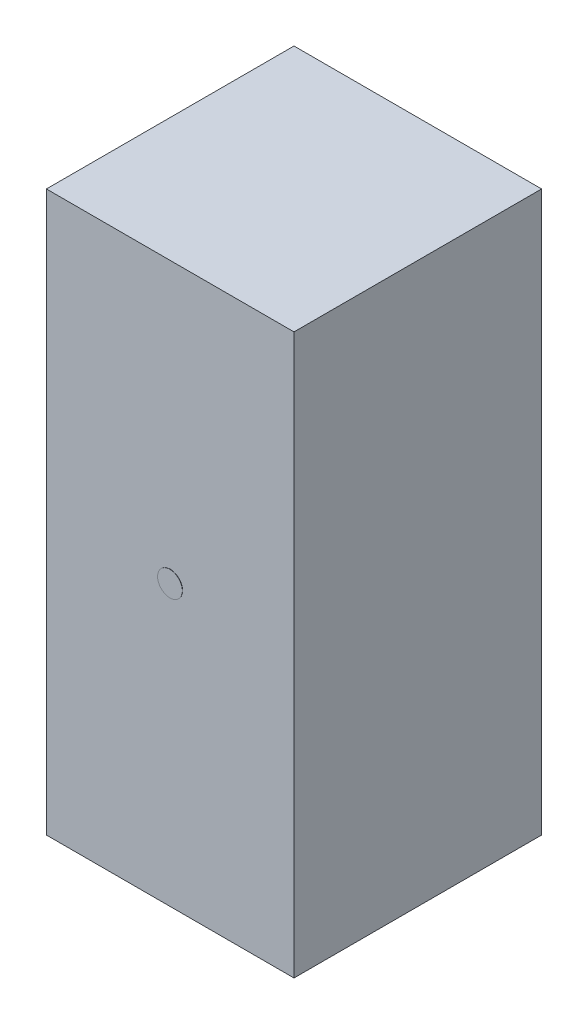
ISO-10303-21;
HEADER;
FILE_DESCRIPTION(('STEP AP214'),'2;1');
FILE_NAME('part.step','',(''),(''),'','','');
FILE_SCHEMA(('AUTOMOTIVE_DESIGN { 1 0 10303 214 1 1 1 1 }'));
ENDSEC;
DATA;
#1=APPLICATION_CONTEXT('core data for automotive mechanical design processes');
#2=APPLICATION_PROTOCOL_DEFINITION('international standard','automotive_design',2000,#1);
#3=PRODUCT_CONTEXT('',#1,'mechanical');
#4=PRODUCT('Part','Part','',(#3));
#5=PRODUCT_RELATED_PRODUCT_CATEGORY('part','',(#4));
#6=PRODUCT_DEFINITION_FORMATION('','',#4);
#7=PRODUCT_DEFINITION_CONTEXT('part definition',#1,'design');
#8=PRODUCT_DEFINITION('design','',#6,#7);
#9=PRODUCT_DEFINITION_SHAPE('','',#8);
#10=(LENGTH_UNIT() NAMED_UNIT(*) SI_UNIT(.MILLI.,.METRE.));
#11=(NAMED_UNIT(*) PLANE_ANGLE_UNIT() SI_UNIT($,.RADIAN.));
#12=(NAMED_UNIT(*) SI_UNIT($,.STERADIAN.) SOLID_ANGLE_UNIT());
#13=UNCERTAINTY_MEASURE_WITH_UNIT(LENGTH_MEASURE(1.E-05),#10,'distance_accuracy_value','');
#14=(GEOMETRIC_REPRESENTATION_CONTEXT(3) GLOBAL_UNCERTAINTY_ASSIGNED_CONTEXT((#13)) GLOBAL_UNIT_ASSIGNED_CONTEXT((#10,
#11,#12)) REPRESENTATION_CONTEXT('',''));
#15=CARTESIAN_POINT('',(0.,0.,0.));
#16=DIRECTION('',(0.,0.,1.));
#17=DIRECTION('',(1.,0.,0.));
#18=AXIS2_PLACEMENT_3D('',#15,#16,#17);
#19=CARTESIAN_POINT('',(50.,226.,-50.));
#20=DIRECTION('',(-1.,0.,0.));
#21=DIRECTION('',(0.,0.,1.));
#22=AXIS2_PLACEMENT_3D('',#19,#20,#21);
#23=PLANE('',#22);
#24=DIRECTION('',(0.,0.,-1.));
#25=VECTOR('',#24,1.);
#26=CARTESIAN_POINT('',(50.,0.,-50.));
#27=LINE('',#26,#25);
#28=CARTESIAN_POINT('',(50.,0.,50.));
#29=VERTEX_POINT('',#28);
#30=CARTESIAN_POINT('',(50.,0.,-50.));
#31=VERTEX_POINT('',#30);
#32=EDGE_CURVE('E115',#29,#31,#27,.T.);
#33=ORIENTED_EDGE('',*,*,#32,.T.);
#34=DIRECTION('',(0.,-1.,0.));
#35=VECTOR('',#34,1.);
#36=CARTESIAN_POINT('',(50.,226.,-50.));
#37=LINE('',#36,#35);
#38=CARTESIAN_POINT('',(50.,226.,-50.));
#39=VERTEX_POINT('',#38);
#40=EDGE_CURVE('E57',#39,#31,#37,.T.);
#41=ORIENTED_EDGE('',*,*,#40,.F.);
#42=DIRECTION('',(0.,0.,-1.));
#43=VECTOR('',#42,1.);
#44=CARTESIAN_POINT('',(50.,226.,-50.));
#45=LINE('',#44,#43);
#46=CARTESIAN_POINT('',(50.,226.,50.));
#47=VERTEX_POINT('',#46);
#48=EDGE_CURVE('E101',#47,#39,#45,.T.);
#49=ORIENTED_EDGE('',*,*,#48,.F.);
#50=DIRECTION('',(0.,-1.,0.));
#51=VECTOR('',#50,1.);
#52=CARTESIAN_POINT('',(50.,226.,50.));
#53=LINE('',#52,#51);
#54=EDGE_CURVE('E111',#47,#29,#53,.T.);
#55=ORIENTED_EDGE('',*,*,#54,.T.);
#56=EDGE_LOOP('',(#33,#41,#49,#55));
#57=FACE_BOUND('',#56,.T.);
#58=ADVANCED_FACE('F49',(#57),#23,.F.);
#59=CARTESIAN_POINT('',(-50.,226.,-50.));
#60=DIRECTION('',(0.,0.,1.));
#61=DIRECTION('',(1.,0.,0.));
#62=AXIS2_PLACEMENT_3D('',#59,#60,#61);
#63=PLANE('',#62);
#64=DIRECTION('',(-1.,0.,0.));
#65=VECTOR('',#64,1.);
#66=CARTESIAN_POINT('',(-50.,0.,-50.));
#67=LINE('',#66,#65);
#68=CARTESIAN_POINT('',(-50.,0.,-50.));
#69=VERTEX_POINT('',#68);
#70=EDGE_CURVE('E106',#31,#69,#67,.T.);
#71=ORIENTED_EDGE('',*,*,#70,.T.);
#72=DIRECTION('',(0.,-1.,0.));
#73=VECTOR('',#72,1.);
#74=CARTESIAN_POINT('',(-50.,226.,-50.));
#75=LINE('',#74,#73);
#76=CARTESIAN_POINT('',(-50.,226.,-50.));
#77=VERTEX_POINT('',#76);
#78=EDGE_CURVE('E104',#77,#69,#75,.T.);
#79=ORIENTED_EDGE('',*,*,#78,.F.);
#80=DIRECTION('',(-1.,0.,0.));
#81=VECTOR('',#80,1.);
#82=CARTESIAN_POINT('',(-50.,226.,-50.));
#83=LINE('',#82,#81);
#84=EDGE_CURVE('E96',#39,#77,#83,.T.);
#85=ORIENTED_EDGE('',*,*,#84,.F.);
#86=ORIENTED_EDGE('',*,*,#40,.T.);
#87=EDGE_LOOP('',(#71,#79,#85,#86));
#88=FACE_BOUND('',#87,.T.);
#89=ADVANCED_FACE('F105',(#88),#63,.F.);
#90=CARTESIAN_POINT('',(-50.,226.,-50.));
#91=DIRECTION('',(1.,0.,0.));
#92=DIRECTION('',(0.,0.,-1.));
#93=AXIS2_PLACEMENT_3D('',#90,#91,#92);
#94=PLANE('',#93);
#95=DIRECTION('',(0.,0.,1.));
#96=VECTOR('',#95,1.);
#97=CARTESIAN_POINT('',(-50.,0.,-50.));
#98=LINE('',#97,#96);
#99=CARTESIAN_POINT('',(-50.,0.,50.));
#100=VERTEX_POINT('',#99);
#101=EDGE_CURVE('E82',#69,#100,#98,.T.);
#102=ORIENTED_EDGE('',*,*,#101,.T.);
#103=DIRECTION('',(0.,-1.,0.));
#104=VECTOR('',#103,1.);
#105=CARTESIAN_POINT('',(-50.,226.,50.));
#106=LINE('',#105,#104);
#107=CARTESIAN_POINT('',(-50.,226.,50.));
#108=VERTEX_POINT('',#107);
#109=EDGE_CURVE('E107',#108,#100,#106,.T.);
#110=ORIENTED_EDGE('',*,*,#109,.F.);
#111=DIRECTION('',(0.,0.,1.));
#112=VECTOR('',#111,1.);
#113=CARTESIAN_POINT('',(-50.,226.,-50.));
#114=LINE('',#113,#112);
#115=EDGE_CURVE('E99',#77,#108,#114,.T.);
#116=ORIENTED_EDGE('',*,*,#115,.F.);
#117=ORIENTED_EDGE('',*,*,#78,.T.);
#118=EDGE_LOOP('',(#102,#110,#116,#117));
#119=FACE_BOUND('',#118,.T.);
#120=ADVANCED_FACE('F109',(#119),#94,.F.);
#121=CARTESIAN_POINT('',(-50.,226.,50.));
#122=DIRECTION('',(0.,0.,-1.));
#123=DIRECTION('',(-1.,0.,0.));
#124=AXIS2_PLACEMENT_3D('',#121,#122,#123);
#125=PLANE('',#124);
#126=CARTESIAN_POINT('',(0.,113.,50.));
#127=DIRECTION('',(0.,0.,-1.));
#128=DIRECTION('',(-1.,0.,0.));
#129=AXIS2_PLACEMENT_3D('',#126,#127,#128);
#130=CIRCLE('',#129,5.);
#131=CARTESIAN_POINT('',(-5.,113.,50.));
#132=VERTEX_POINT('',#131);
#133=EDGE_CURVE('E11',#132,#132,#130,.F.);
#134=ORIENTED_EDGE('',*,*,#133,.F.);
#135=EDGE_LOOP('',(#134));
#136=FACE_BOUND('',#135,.T.);
#137=DIRECTION('',(1.,0.,0.));
#138=VECTOR('',#137,1.);
#139=CARTESIAN_POINT('',(-50.,0.,50.));
#140=LINE('',#139,#138);
#141=EDGE_CURVE('E88',#100,#29,#140,.T.);
#142=ORIENTED_EDGE('',*,*,#141,.T.);
#143=ORIENTED_EDGE('',*,*,#54,.F.);
#144=DIRECTION('',(1.,0.,0.));
#145=VECTOR('',#144,1.);
#146=CARTESIAN_POINT('',(-50.,226.,50.));
#147=LINE('',#146,#145);
#148=EDGE_CURVE('E65',#108,#47,#147,.T.);
#149=ORIENTED_EDGE('',*,*,#148,.F.);
#150=ORIENTED_EDGE('',*,*,#109,.T.);
#151=EDGE_LOOP('',(#142,#143,#149,#150));
#152=FACE_BOUND('',#151,.T.);
#153=ADVANCED_FACE('F138',(#136,#152),#125,.F.);
#154=CARTESIAN_POINT('',(0.,226.,0.));
#155=DIRECTION('',(0.,1.,0.));
#156=DIRECTION('',(0.,0.,1.));
#157=AXIS2_PLACEMENT_3D('',#154,#155,#156);
#158=PLANE('',#157);
#159=ORIENTED_EDGE('',*,*,#48,.T.);
#160=ORIENTED_EDGE('',*,*,#84,.T.);
#161=ORIENTED_EDGE('',*,*,#115,.T.);
#162=ORIENTED_EDGE('',*,*,#148,.T.);
#163=EDGE_LOOP('',(#159,#160,#161,#162));
#164=FACE_BOUND('',#163,.T.);
#165=ADVANCED_FACE('F97',(#164),#158,.T.);
#166=CARTESIAN_POINT('',(0.,0.,0.));
#167=DIRECTION('',(0.,1.,0.));
#168=DIRECTION('',(0.,0.,1.));
#169=AXIS2_PLACEMENT_3D('',#166,#167,#168);
#170=PLANE('',#169);
#171=ORIENTED_EDGE('',*,*,#32,.F.);
#172=ORIENTED_EDGE('',*,*,#141,.F.);
#173=ORIENTED_EDGE('',*,*,#101,.F.);
#174=ORIENTED_EDGE('',*,*,#70,.F.);
#175=EDGE_LOOP('',(#171,#172,#173,#174));
#176=FACE_BOUND('',#175,.T.);
#177=ADVANCED_FACE('F126',(#176),#170,.F.);
#178=CARTESIAN_POINT('',(0.,113.,50.1));
#179=DIRECTION('',(0.,0.,-1.));
#180=DIRECTION('',(-1.,0.,0.));
#181=AXIS2_PLACEMENT_3D('',#178,#179,#180);
#182=CYLINDRICAL_SURFACE('',#181,5.);
#183=CARTESIAN_POINT('',(0.,113.,50.1));
#184=DIRECTION('',(0.,0.,1.));
#185=DIRECTION('',(1.,0.,0.));
#186=AXIS2_PLACEMENT_3D('',#183,#184,#185);
#187=CIRCLE('',#186,5.);
#188=CARTESIAN_POINT('',(5.,113.,50.1));
#189=VERTEX_POINT('',#188);
#190=EDGE_CURVE('E118',#189,#189,#187,.T.);
#191=ORIENTED_EDGE('',*,*,#190,.F.);
#192=EDGE_LOOP('',(#191));
#193=FACE_BOUND('',#192,.T.);
#194=ORIENTED_EDGE('',*,*,#133,.T.);
#195=EDGE_LOOP('',(#194));
#196=FACE_BOUND('',#195,.T.);
#197=ADVANCED_FACE('F128',(#193,#196),#182,.T.);
#198=CARTESIAN_POINT('',(0.,113.,50.1));
#199=DIRECTION('',(0.,0.,1.));
#200=DIRECTION('',(1.,0.,0.));
#201=AXIS2_PLACEMENT_3D('',#198,#199,#200);
#202=PLANE('',#201);
#203=ORIENTED_EDGE('',*,*,#190,.T.);
#204=EDGE_LOOP('',(#203));
#205=FACE_BOUND('',#204,.T.);
#206=ADVANCED_FACE('F135',(#205),#202,.T.);
#207=CLOSED_SHELL('',(#58,#89,#120,#153,#165,#177,#197,#206));
#208=MANIFOLD_SOLID_BREP('B2',#207);
#209=ADVANCED_BREP_SHAPE_REPRESENTATION('',(#18,#208),#14);
#210=SHAPE_DEFINITION_REPRESENTATION(#9,#209);
ENDSEC;
END-ISO-10303-21;
